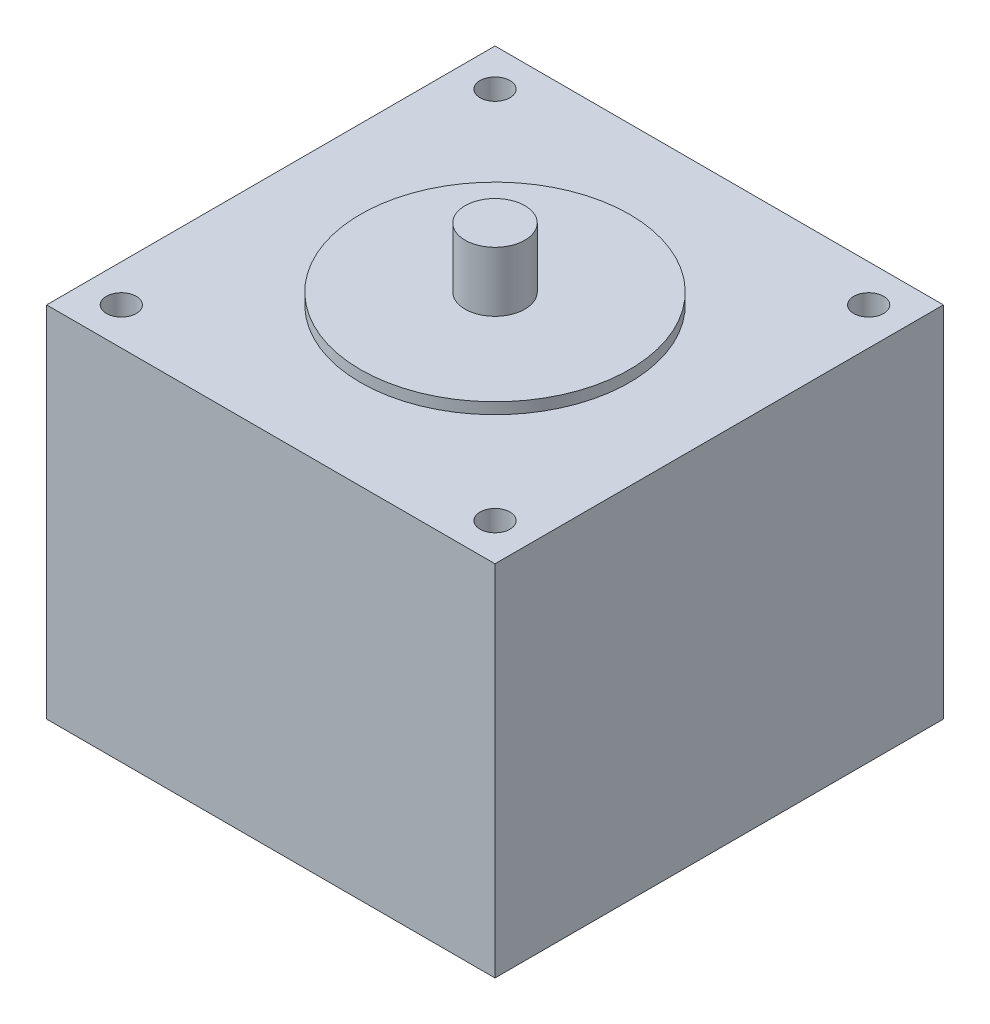
ISO-10303-21;
HEADER;
FILE_DESCRIPTION(('STEP AP214'),'2;1');
FILE_NAME('part.step','',(''),(''),'','','');
FILE_SCHEMA(('AUTOMOTIVE_DESIGN { 1 0 10303 214 1 1 1 1 }'));
ENDSEC;
DATA;
#1=APPLICATION_CONTEXT('core data for automotive mechanical design processes');
#2=APPLICATION_PROTOCOL_DEFINITION('international standard','automotive_design',2000,#1);
#3=PRODUCT_CONTEXT('',#1,'mechanical');
#4=PRODUCT('Part','Part','',(#3));
#5=PRODUCT_RELATED_PRODUCT_CATEGORY('part','',(#4));
#6=PRODUCT_DEFINITION_FORMATION('','',#4);
#7=PRODUCT_DEFINITION_CONTEXT('part definition',#1,'design');
#8=PRODUCT_DEFINITION('design','',#6,#7);
#9=PRODUCT_DEFINITION_SHAPE('','',#8);
#10=(LENGTH_UNIT() NAMED_UNIT(*) SI_UNIT(.MILLI.,.METRE.));
#11=(NAMED_UNIT(*) PLANE_ANGLE_UNIT() SI_UNIT($,.RADIAN.));
#12=(NAMED_UNIT(*) SI_UNIT($,.STERADIAN.) SOLID_ANGLE_UNIT());
#13=UNCERTAINTY_MEASURE_WITH_UNIT(LENGTH_MEASURE(1.E-05),#10,'distance_accuracy_value','');
#14=(GEOMETRIC_REPRESENTATION_CONTEXT(3) GLOBAL_UNCERTAINTY_ASSIGNED_CONTEXT((#13)) GLOBAL_UNIT_ASSIGNED_CONTEXT((#10,
#11,#12)) REPRESENTATION_CONTEXT('',''));
#15=CARTESIAN_POINT('',(0.,0.,0.));
#16=DIRECTION('',(0.,0.,1.));
#17=DIRECTION('',(1.,0.,0.));
#18=AXIS2_PLACEMENT_3D('',#15,#16,#17);
#19=CARTESIAN_POINT('',(0.,48.,0.));
#20=DIRECTION('',(0.,-1.,0.));
#21=DIRECTION('',(0.,0.,-1.));
#22=AXIS2_PLACEMENT_3D('',#19,#20,#21);
#23=PLANE('',#22);
#24=CARTESIAN_POINT('',(0.,48.,0.));
#25=DIRECTION('',(0.,1.,0.));
#26=DIRECTION('',(0.,0.,1.));
#27=AXIS2_PLACEMENT_3D('',#24,#25,#26);
#28=CIRCLE('',#27,18.);
#29=CARTESIAN_POINT('',(0.,48.,18.));
#30=VERTEX_POINT('',#29);
#31=EDGE_CURVE('E11',#30,#30,#28,.T.);
#32=ORIENTED_EDGE('',*,*,#31,.F.);
#33=EDGE_LOOP('',(#32));
#34=FACE_BOUND('',#33,.T.);
#35=DIRECTION('',(0.,0.,1.));
#36=VECTOR('',#35,1.);
#37=CARTESIAN_POINT('',(-30.,48.,-30.));
#38=LINE('',#37,#36);
#39=CARTESIAN_POINT('',(-30.,48.,-30.));
#40=VERTEX_POINT('',#39);
#41=CARTESIAN_POINT('',(-30.,48.,30.));
#42=VERTEX_POINT('',#41);
#43=EDGE_CURVE('E87',#40,#42,#38,.T.);
#44=ORIENTED_EDGE('',*,*,#43,.T.);
#45=DIRECTION('',(1.,0.,0.));
#46=VECTOR('',#45,1.);
#47=CARTESIAN_POINT('',(30.,48.,30.));
#48=LINE('',#47,#46);
#49=CARTESIAN_POINT('',(30.,48.,30.));
#50=VERTEX_POINT('',#49);
#51=EDGE_CURVE('E82',#42,#50,#48,.T.);
#52=ORIENTED_EDGE('',*,*,#51,.T.);
#53=DIRECTION('',(0.,0.,-1.));
#54=VECTOR('',#53,1.);
#55=CARTESIAN_POINT('',(30.,48.,-30.));
#56=LINE('',#55,#54);
#57=CARTESIAN_POINT('',(30.,48.,-30.));
#58=VERTEX_POINT('',#57);
#59=EDGE_CURVE('E85',#50,#58,#56,.T.);
#60=ORIENTED_EDGE('',*,*,#59,.T.);
#61=DIRECTION('',(-1.,0.,0.));
#62=VECTOR('',#61,1.);
#63=CARTESIAN_POINT('',(30.,48.,-30.));
#64=LINE('',#63,#62);
#65=EDGE_CURVE('E51',#58,#40,#64,.T.);
#66=ORIENTED_EDGE('',*,*,#65,.T.);
#67=EDGE_LOOP('',(#44,#52,#60,#66));
#68=FACE_BOUND('',#67,.T.);
#69=CARTESIAN_POINT('',(-25.,48.,-25.));
#70=DIRECTION('',(0.,1.,0.));
#71=DIRECTION('',(0.,0.,1.));
#72=AXIS2_PLACEMENT_3D('',#69,#70,#71);
#73=CIRCLE('',#72,2.);
#74=CARTESIAN_POINT('',(-25.,48.,-23.));
#75=VERTEX_POINT('',#74);
#76=EDGE_CURVE('E103',#75,#75,#73,.T.);
#77=ORIENTED_EDGE('',*,*,#76,.F.);
#78=EDGE_LOOP('',(#77));
#79=FACE_BOUND('',#78,.T.);
#80=CARTESIAN_POINT('',(25.,48.,-25.));
#81=DIRECTION('',(0.,1.,0.));
#82=DIRECTION('',(0.,0.,1.));
#83=AXIS2_PLACEMENT_3D('',#80,#81,#82);
#84=CIRCLE('',#83,2.);
#85=CARTESIAN_POINT('',(25.,48.,-23.));
#86=VERTEX_POINT('',#85);
#87=EDGE_CURVE('E118',#86,#86,#84,.T.);
#88=ORIENTED_EDGE('',*,*,#87,.F.);
#89=EDGE_LOOP('',(#88));
#90=FACE_BOUND('',#89,.T.);
#91=CARTESIAN_POINT('',(25.,48.,25.));
#92=DIRECTION('',(0.,1.,0.));
#93=DIRECTION('',(0.,0.,1.));
#94=AXIS2_PLACEMENT_3D('',#91,#92,#93);
#95=CIRCLE('',#94,2.);
#96=CARTESIAN_POINT('',(25.,48.,27.));
#97=VERTEX_POINT('',#96);
#98=EDGE_CURVE('E124',#97,#97,#95,.T.);
#99=ORIENTED_EDGE('',*,*,#98,.F.);
#100=EDGE_LOOP('',(#99));
#101=FACE_BOUND('',#100,.T.);
#102=CARTESIAN_POINT('',(-25.,48.,25.));
#103=DIRECTION('',(0.,1.,0.));
#104=DIRECTION('',(0.,0.,1.));
#105=AXIS2_PLACEMENT_3D('',#102,#103,#104);
#106=CIRCLE('',#105,2.);
#107=CARTESIAN_POINT('',(-25.,48.,27.));
#108=VERTEX_POINT('',#107);
#109=EDGE_CURVE('E130',#108,#108,#106,.T.);
#110=ORIENTED_EDGE('',*,*,#109,.F.);
#111=EDGE_LOOP('',(#110));
#112=FACE_BOUND('',#111,.T.);
#113=ADVANCED_FACE('F33',(#34,#68,#79,#90,#101,#112),#23,.F.);
#114=CARTESIAN_POINT('',(0.,0.,0.));
#115=DIRECTION('',(0.,-1.,0.));
#116=DIRECTION('',(0.,0.,-1.));
#117=AXIS2_PLACEMENT_3D('',#114,#115,#116);
#118=PLANE('',#117);
#119=CARTESIAN_POINT('',(25.,0.,25.));
#120=DIRECTION('',(0.,1.,0.));
#121=DIRECTION('',(0.,0.,1.));
#122=AXIS2_PLACEMENT_3D('',#119,#120,#121);
#123=CIRCLE('',#122,2.);
#124=CARTESIAN_POINT('',(25.,0.,27.));
#125=VERTEX_POINT('',#124);
#126=EDGE_CURVE('E127',#125,#125,#123,.T.);
#127=ORIENTED_EDGE('',*,*,#126,.T.);
#128=EDGE_LOOP('',(#127));
#129=FACE_BOUND('',#128,.T.);
#130=CARTESIAN_POINT('',(-25.,0.,-25.));
#131=DIRECTION('',(0.,1.,0.));
#132=DIRECTION('',(0.,0.,1.));
#133=AXIS2_PLACEMENT_3D('',#130,#131,#132);
#134=CIRCLE('',#133,2.);
#135=CARTESIAN_POINT('',(-25.,0.,-23.));
#136=VERTEX_POINT('',#135);
#137=EDGE_CURVE('E115',#136,#136,#134,.T.);
#138=ORIENTED_EDGE('',*,*,#137,.T.);
#139=EDGE_LOOP('',(#138));
#140=FACE_BOUND('',#139,.T.);
#141=DIRECTION('',(0.,0.,1.));
#142=VECTOR('',#141,1.);
#143=CARTESIAN_POINT('',(-30.,0.,-30.));
#144=LINE('',#143,#142);
#145=CARTESIAN_POINT('',(-30.,0.,-30.));
#146=VERTEX_POINT('',#145);
#147=CARTESIAN_POINT('',(-30.,0.,30.));
#148=VERTEX_POINT('',#147);
#149=EDGE_CURVE('E100',#146,#148,#144,.T.);
#150=ORIENTED_EDGE('',*,*,#149,.F.);
#151=DIRECTION('',(-1.,0.,0.));
#152=VECTOR('',#151,1.);
#153=CARTESIAN_POINT('',(30.,0.,-30.));
#154=LINE('',#153,#152);
#155=CARTESIAN_POINT('',(30.,0.,-30.));
#156=VERTEX_POINT('',#155);
#157=EDGE_CURVE('E74',#156,#146,#154,.T.);
#158=ORIENTED_EDGE('',*,*,#157,.F.);
#159=DIRECTION('',(0.,0.,-1.));
#160=VECTOR('',#159,1.);
#161=CARTESIAN_POINT('',(30.,0.,-30.));
#162=LINE('',#161,#160);
#163=CARTESIAN_POINT('',(30.,0.,30.));
#164=VERTEX_POINT('',#163);
#165=EDGE_CURVE('E68',#164,#156,#162,.T.);
#166=ORIENTED_EDGE('',*,*,#165,.F.);
#167=DIRECTION('',(1.,0.,0.));
#168=VECTOR('',#167,1.);
#169=CARTESIAN_POINT('',(30.,0.,30.));
#170=LINE('',#169,#168);
#171=EDGE_CURVE('E92',#148,#164,#170,.T.);
#172=ORIENTED_EDGE('',*,*,#171,.F.);
#173=EDGE_LOOP('',(#150,#158,#166,#172));
#174=FACE_BOUND('',#173,.T.);
#175=CARTESIAN_POINT('',(25.,0.,-25.));
#176=DIRECTION('',(0.,1.,0.));
#177=DIRECTION('',(0.,0.,1.));
#178=AXIS2_PLACEMENT_3D('',#175,#176,#177);
#179=CIRCLE('',#178,2.);
#180=CARTESIAN_POINT('',(25.,0.,-23.));
#181=VERTEX_POINT('',#180);
#182=EDGE_CURVE('E121',#181,#181,#179,.T.);
#183=ORIENTED_EDGE('',*,*,#182,.T.);
#184=EDGE_LOOP('',(#183));
#185=FACE_BOUND('',#184,.T.);
#186=CARTESIAN_POINT('',(-25.,0.,25.));
#187=DIRECTION('',(0.,1.,0.));
#188=DIRECTION('',(0.,0.,1.));
#189=AXIS2_PLACEMENT_3D('',#186,#187,#188);
#190=CIRCLE('',#189,2.);
#191=CARTESIAN_POINT('',(-25.,0.,27.));
#192=VERTEX_POINT('',#191);
#193=EDGE_CURVE('E133',#192,#192,#190,.T.);
#194=ORIENTED_EDGE('',*,*,#193,.T.);
#195=EDGE_LOOP('',(#194));
#196=FACE_BOUND('',#195,.T.);
#197=ADVANCED_FACE('F111',(#129,#140,#174,#185,#196),#118,.T.);
#198=CARTESIAN_POINT('',(-30.,48.,-30.));
#199=DIRECTION('',(1.,0.,0.));
#200=DIRECTION('',(0.,0.,-1.));
#201=AXIS2_PLACEMENT_3D('',#198,#199,#200);
#202=PLANE('',#201);
#203=ORIENTED_EDGE('',*,*,#149,.T.);
#204=DIRECTION('',(0.,-1.,0.));
#205=VECTOR('',#204,1.);
#206=CARTESIAN_POINT('',(-30.,48.,30.));
#207=LINE('',#206,#205);
#208=EDGE_CURVE('E37',#42,#148,#207,.T.);
#209=ORIENTED_EDGE('',*,*,#208,.F.);
#210=ORIENTED_EDGE('',*,*,#43,.F.);
#211=DIRECTION('',(0.,-1.,0.));
#212=VECTOR('',#211,1.);
#213=CARTESIAN_POINT('',(-30.,48.,-30.));
#214=LINE('',#213,#212);
#215=EDGE_CURVE('E96',#40,#146,#214,.T.);
#216=ORIENTED_EDGE('',*,*,#215,.T.);
#217=EDGE_LOOP('',(#203,#209,#210,#216));
#218=FACE_BOUND('',#217,.T.);
#219=ADVANCED_FACE('F35',(#218),#202,.F.);
#220=CARTESIAN_POINT('',(30.,48.,30.));
#221=DIRECTION('',(0.,0.,-1.));
#222=DIRECTION('',(-1.,0.,0.));
#223=AXIS2_PLACEMENT_3D('',#220,#221,#222);
#224=PLANE('',#223);
#225=ORIENTED_EDGE('',*,*,#171,.T.);
#226=DIRECTION('',(0.,-1.,0.));
#227=VECTOR('',#226,1.);
#228=CARTESIAN_POINT('',(30.,48.,30.));
#229=LINE('',#228,#227);
#230=EDGE_CURVE('E90',#50,#164,#229,.T.);
#231=ORIENTED_EDGE('',*,*,#230,.F.);
#232=ORIENTED_EDGE('',*,*,#51,.F.);
#233=ORIENTED_EDGE('',*,*,#208,.T.);
#234=EDGE_LOOP('',(#225,#231,#232,#233));
#235=FACE_BOUND('',#234,.T.);
#236=ADVANCED_FACE('F91',(#235),#224,.F.);
#237=CARTESIAN_POINT('',(30.,48.,-30.));
#238=DIRECTION('',(-1.,0.,0.));
#239=DIRECTION('',(0.,0.,1.));
#240=AXIS2_PLACEMENT_3D('',#237,#238,#239);
#241=PLANE('',#240);
#242=ORIENTED_EDGE('',*,*,#165,.T.);
#243=DIRECTION('',(0.,-1.,0.));
#244=VECTOR('',#243,1.);
#245=CARTESIAN_POINT('',(30.,48.,-30.));
#246=LINE('',#245,#244);
#247=EDGE_CURVE('E93',#58,#156,#246,.T.);
#248=ORIENTED_EDGE('',*,*,#247,.F.);
#249=ORIENTED_EDGE('',*,*,#59,.F.);
#250=ORIENTED_EDGE('',*,*,#230,.T.);
#251=EDGE_LOOP('',(#242,#248,#249,#250));
#252=FACE_BOUND('',#251,.T.);
#253=ADVANCED_FACE('F94',(#252),#241,.F.);
#254=CARTESIAN_POINT('',(30.,48.,-30.));
#255=DIRECTION('',(0.,0.,1.));
#256=DIRECTION('',(1.,0.,0.));
#257=AXIS2_PLACEMENT_3D('',#254,#255,#256);
#258=PLANE('',#257);
#259=ORIENTED_EDGE('',*,*,#157,.T.);
#260=ORIENTED_EDGE('',*,*,#215,.F.);
#261=ORIENTED_EDGE('',*,*,#65,.F.);
#262=ORIENTED_EDGE('',*,*,#247,.T.);
#263=EDGE_LOOP('',(#259,#260,#261,#262));
#264=FACE_BOUND('',#263,.T.);
#265=ADVANCED_FACE('F108',(#264),#258,.F.);
#266=CARTESIAN_POINT('',(-25.,48.,-25.));
#267=DIRECTION('',(0.,-1.,0.));
#268=DIRECTION('',(0.,0.,-1.));
#269=AXIS2_PLACEMENT_3D('',#266,#267,#268);
#270=CYLINDRICAL_SURFACE('',#269,2.);
#271=ORIENTED_EDGE('',*,*,#76,.T.);
#272=EDGE_LOOP('',(#271));
#273=FACE_BOUND('',#272,.T.);
#274=ORIENTED_EDGE('',*,*,#137,.F.);
#275=EDGE_LOOP('',(#274));
#276=FACE_BOUND('',#275,.T.);
#277=ADVANCED_FACE('F177',(#273,#276),#270,.F.);
#278=CARTESIAN_POINT('',(25.,48.,-25.));
#279=DIRECTION('',(0.,-1.,0.));
#280=DIRECTION('',(0.,0.,-1.));
#281=AXIS2_PLACEMENT_3D('',#278,#279,#280);
#282=CYLINDRICAL_SURFACE('',#281,2.);
#283=ORIENTED_EDGE('',*,*,#87,.T.);
#284=EDGE_LOOP('',(#283));
#285=FACE_BOUND('',#284,.T.);
#286=ORIENTED_EDGE('',*,*,#182,.F.);
#287=EDGE_LOOP('',(#286));
#288=FACE_BOUND('',#287,.T.);
#289=ADVANCED_FACE('F222',(#285,#288),#282,.F.);
#290=CARTESIAN_POINT('',(25.,48.,25.));
#291=DIRECTION('',(0.,-1.,0.));
#292=DIRECTION('',(0.,0.,-1.));
#293=AXIS2_PLACEMENT_3D('',#290,#291,#292);
#294=CYLINDRICAL_SURFACE('',#293,2.);
#295=ORIENTED_EDGE('',*,*,#98,.T.);
#296=EDGE_LOOP('',(#295));
#297=FACE_BOUND('',#296,.T.);
#298=ORIENTED_EDGE('',*,*,#126,.F.);
#299=EDGE_LOOP('',(#298));
#300=FACE_BOUND('',#299,.T.);
#301=ADVANCED_FACE('F230',(#297,#300),#294,.F.);
#302=CARTESIAN_POINT('',(-25.,48.,25.));
#303=DIRECTION('',(0.,-1.,0.));
#304=DIRECTION('',(0.,0.,-1.));
#305=AXIS2_PLACEMENT_3D('',#302,#303,#304);
#306=CYLINDRICAL_SURFACE('',#305,2.);
#307=ORIENTED_EDGE('',*,*,#109,.T.);
#308=EDGE_LOOP('',(#307));
#309=FACE_BOUND('',#308,.T.);
#310=ORIENTED_EDGE('',*,*,#193,.F.);
#311=EDGE_LOOP('',(#310));
#312=FACE_BOUND('',#311,.T.);
#313=ADVANCED_FACE('F165',(#309,#312),#306,.F.);
#314=CARTESIAN_POINT('',(0.,57.5,0.));
#315=DIRECTION('',(0.,1.,0.));
#316=DIRECTION('',(0.,0.,1.));
#317=AXIS2_PLACEMENT_3D('',#314,#315,#316);
#318=CYLINDRICAL_SURFACE('',#317,18.);
#319=CARTESIAN_POINT('',(0.,49.5,0.));
#320=DIRECTION('',(0.,1.,0.));
#321=DIRECTION('',(0.,0.,1.));
#322=AXIS2_PLACEMENT_3D('',#319,#320,#321);
#323=CIRCLE('',#322,18.);
#324=CARTESIAN_POINT('',(0.,49.5,18.));
#325=VERTEX_POINT('',#324);
#326=EDGE_CURVE('E136',#325,#325,#323,.T.);
#327=ORIENTED_EDGE('',*,*,#326,.F.);
#328=EDGE_LOOP('',(#327));
#329=FACE_BOUND('',#328,.T.);
#330=ORIENTED_EDGE('',*,*,#31,.T.);
#331=EDGE_LOOP('',(#330));
#332=FACE_BOUND('',#331,.T.);
#333=ADVANCED_FACE('F159',(#329,#332),#318,.T.);
#334=CARTESIAN_POINT('',(18.,49.5,0.));
#335=DIRECTION('',(0.,-1.,0.));
#336=DIRECTION('',(0.,0.,-1.));
#337=AXIS2_PLACEMENT_3D('',#334,#335,#336);
#338=PLANE('',#337);
#339=CARTESIAN_POINT('',(0.,49.5,0.));
#340=DIRECTION('',(0.,1.,0.));
#341=DIRECTION('',(0.,0.,1.));
#342=AXIS2_PLACEMENT_3D('',#339,#340,#341);
#343=CIRCLE('',#342,3.99999999999998);
#344=CARTESIAN_POINT('',(0.,49.5,3.99999999999998));
#345=VERTEX_POINT('',#344);
#346=EDGE_CURVE('E141',#345,#345,#343,.T.);
#347=ORIENTED_EDGE('',*,*,#346,.F.);
#348=EDGE_LOOP('',(#347));
#349=FACE_BOUND('',#348,.T.);
#350=ORIENTED_EDGE('',*,*,#326,.T.);
#351=EDGE_LOOP('',(#350));
#352=FACE_BOUND('',#351,.T.);
#353=ADVANCED_FACE('F153',(#349,#352),#338,.F.);
#354=CARTESIAN_POINT('',(0.,57.5,0.));
#355=DIRECTION('',(0.,1.,0.));
#356=DIRECTION('',(0.,0.,1.));
#357=AXIS2_PLACEMENT_3D('',#354,#355,#356);
#358=CYLINDRICAL_SURFACE('',#357,3.99999999999998);
#359=CARTESIAN_POINT('',(0.,57.5,0.));
#360=DIRECTION('',(0.,1.,0.));
#361=DIRECTION('',(0.,0.,1.));
#362=AXIS2_PLACEMENT_3D('',#359,#360,#361);
#363=CIRCLE('',#362,3.99999999999998);
#364=CARTESIAN_POINT('',(0.,57.5,3.99999999999998));
#365=VERTEX_POINT('',#364);
#366=EDGE_CURVE('E144',#365,#365,#363,.T.);
#367=ORIENTED_EDGE('',*,*,#366,.F.);
#368=EDGE_LOOP('',(#367));
#369=FACE_BOUND('',#368,.T.);
#370=ORIENTED_EDGE('',*,*,#346,.T.);
#371=EDGE_LOOP('',(#370));
#372=FACE_BOUND('',#371,.T.);
#373=ADVANCED_FACE('F150',(#369,#372),#358,.T.);
#374=CARTESIAN_POINT('',(3.99999999999998,57.5,0.));
#375=DIRECTION('',(0.,-1.,0.));
#376=DIRECTION('',(0.,0.,-1.));
#377=AXIS2_PLACEMENT_3D('',#374,#375,#376);
#378=PLANE('',#377);
#379=ORIENTED_EDGE('',*,*,#366,.T.);
#380=EDGE_LOOP('',(#379));
#381=FACE_BOUND('',#380,.T.);
#382=ADVANCED_FACE('F148',(#381),#378,.F.);
#383=CLOSED_SHELL('',(#113,#197,#219,#236,#253,#265,#277,#289,#301,#313,#333,#353,#373,#382));
#384=MANIFOLD_SOLID_BREP('B2',#383);
#385=ADVANCED_BREP_SHAPE_REPRESENTATION('',(#18,#384),#14);
#386=SHAPE_DEFINITION_REPRESENTATION(#9,#385);
ENDSEC;
END-ISO-10303-21;
